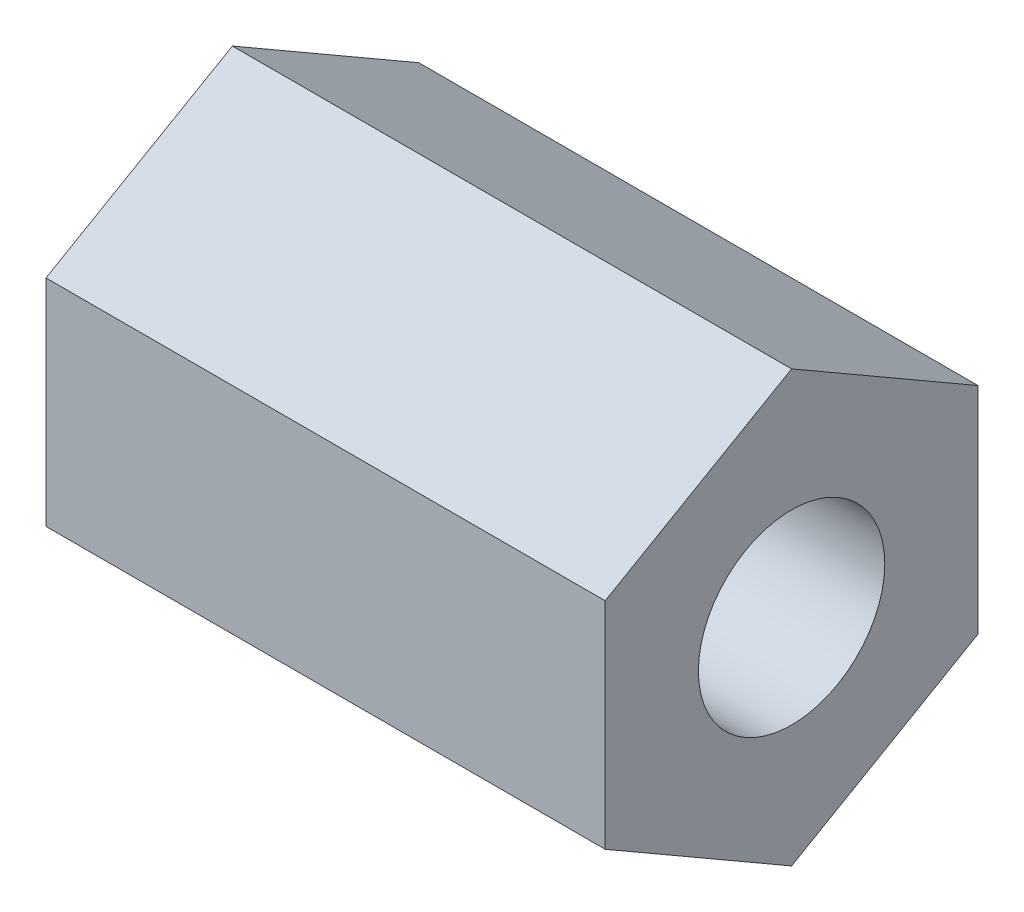
ISO-10303-21;
HEADER;
FILE_DESCRIPTION(('STEP AP214'),'2;1');
FILE_NAME('part.step','',(''),(''),'','','');
FILE_SCHEMA(('AUTOMOTIVE_DESIGN { 1 0 10303 214 1 1 1 1 }'));
ENDSEC;
DATA;
#1=APPLICATION_CONTEXT('core data for automotive mechanical design processes');
#2=APPLICATION_PROTOCOL_DEFINITION('international standard','automotive_design',2000,#1);
#3=PRODUCT_CONTEXT('',#1,'mechanical');
#4=PRODUCT('Part','Part','',(#3));
#5=PRODUCT_RELATED_PRODUCT_CATEGORY('part','',(#4));
#6=PRODUCT_DEFINITION_FORMATION('','',#4);
#7=PRODUCT_DEFINITION_CONTEXT('part definition',#1,'design');
#8=PRODUCT_DEFINITION('design','',#6,#7);
#9=PRODUCT_DEFINITION_SHAPE('','',#8);
#10=(LENGTH_UNIT() NAMED_UNIT(*) SI_UNIT(.MILLI.,.METRE.));
#11=(NAMED_UNIT(*) PLANE_ANGLE_UNIT() SI_UNIT($,.RADIAN.));
#12=(NAMED_UNIT(*) SI_UNIT($,.STERADIAN.) SOLID_ANGLE_UNIT());
#13=UNCERTAINTY_MEASURE_WITH_UNIT(LENGTH_MEASURE(1.E-05),#10,'distance_accuracy_value','');
#14=(GEOMETRIC_REPRESENTATION_CONTEXT(3) GLOBAL_UNCERTAINTY_ASSIGNED_CONTEXT((#13)) GLOBAL_UNIT_ASSIGNED_CONTEXT((#10,
#11,#12)) REPRESENTATION_CONTEXT('',''));
#15=CARTESIAN_POINT('',(0.,0.,0.));
#16=DIRECTION('',(0.,0.,1.));
#17=DIRECTION('',(1.,0.,0.));
#18=AXIS2_PLACEMENT_3D('',#15,#16,#17);
#19=CARTESIAN_POINT('',(19.05,0.,0.));
#20=DIRECTION('',(1.,0.,0.));
#21=DIRECTION('',(0.,0.,-1.));
#22=AXIS2_PLACEMENT_3D('',#19,#20,#21);
#23=PLANE('',#22);
#24=DIRECTION('',(0.,0.499999999999995,0.866025403784442));
#25=VECTOR('',#24,1.);
#26=CARTESIAN_POINT('',(19.05,3.66617420935419,-6.34999999999995));
#27=LINE('',#26,#25);
#28=CARTESIAN_POINT('',(19.05,3.66617420935419,-6.34999999999995));
#29=VERTEX_POINT('',#28);
#30=CARTESIAN_POINT('',(19.05,7.33234841870824,0.));
#31=VERTEX_POINT('',#30);
#32=EDGE_CURVE('E129',#29,#31,#27,.T.);
#33=ORIENTED_EDGE('',*,*,#32,.T.);
#34=DIRECTION('',(0.,-0.500000000000001,0.866025403784438));
#35=VECTOR('',#34,1.);
#36=CARTESIAN_POINT('',(19.05,7.33234841870824,0.));
#37=LINE('',#36,#35);
#38=CARTESIAN_POINT('',(19.05,3.6661742093541,6.35));
#39=VERTEX_POINT('',#38);
#40=EDGE_CURVE('E87',#31,#39,#37,.T.);
#41=ORIENTED_EDGE('',*,*,#40,.T.);
#42=DIRECTION('',(0.,-1.,0.));
#43=VECTOR('',#42,1.);
#44=CARTESIAN_POINT('',(19.05,3.6661742093541,6.35));
#45=LINE('',#44,#43);
#46=CARTESIAN_POINT('',(19.05,-3.66617420935415,6.34999999999997));
#47=VERTEX_POINT('',#46);
#48=EDGE_CURVE('E100',#39,#47,#45,.T.);
#49=ORIENTED_EDGE('',*,*,#48,.T.);
#50=DIRECTION('',(0.,-0.499999999999995,-0.866025403784442));
#51=VECTOR('',#50,1.);
#52=CARTESIAN_POINT('',(19.05,-3.66617420935415,6.34999999999997));
#53=LINE('',#52,#51);
#54=CARTESIAN_POINT('',(19.05,-7.33234841870824,0.));
#55=VERTEX_POINT('',#54);
#56=EDGE_CURVE('E94',#47,#55,#53,.T.);
#57=ORIENTED_EDGE('',*,*,#56,.T.);
#58=DIRECTION('',(0.,0.500000000000007,-0.866025403784435));
#59=VECTOR('',#58,1.);
#60=CARTESIAN_POINT('',(19.05,-7.33234841870824,0.));
#61=LINE('',#60,#59);
#62=CARTESIAN_POINT('',(19.05,-3.66617420935406,-6.35000000000002));
#63=VERTEX_POINT('',#62);
#64=EDGE_CURVE('E98',#55,#63,#61,.T.);
#65=ORIENTED_EDGE('',*,*,#64,.T.);
#66=DIRECTION('',(0.,1.,0.));
#67=VECTOR('',#66,1.);
#68=CARTESIAN_POINT('',(19.05,-3.66617420935406,-6.35000000000002));
#69=LINE('',#68,#67);
#70=EDGE_CURVE('E50',#63,#29,#69,.T.);
#71=ORIENTED_EDGE('',*,*,#70,.T.);
#72=EDGE_LOOP('',(#33,#41,#49,#57,#65,#71));
#73=FACE_BOUND('',#72,.T.);
#74=CARTESIAN_POINT('',(19.05,0.,0.));
#75=DIRECTION('',(1.,0.,0.));
#76=DIRECTION('',(0.,0.,-1.));
#77=AXIS2_PLACEMENT_3D('',#74,#75,#76);
#78=CIRCLE('',#77,3.175);
#79=CARTESIAN_POINT('',(19.05,0.,-3.175));
#80=VERTEX_POINT('',#79);
#81=EDGE_CURVE('E122',#80,#80,#78,.T.);
#82=ORIENTED_EDGE('',*,*,#81,.F.);
#83=EDGE_LOOP('',(#82));
#84=FACE_BOUND('',#83,.T.);
#85=ADVANCED_FACE('F33',(#73,#84),#23,.T.);
#86=CARTESIAN_POINT('',(0.,0.,0.));
#87=DIRECTION('',(1.,0.,0.));
#88=DIRECTION('',(0.,0.,-1.));
#89=AXIS2_PLACEMENT_3D('',#86,#87,#88);
#90=PLANE('',#89);
#91=DIRECTION('',(0.,0.499999999999995,0.866025403784442));
#92=VECTOR('',#91,1.);
#93=CARTESIAN_POINT('',(0.,3.66617420935419,-6.34999999999995));
#94=LINE('',#93,#92);
#95=CARTESIAN_POINT('',(0.,3.66617420935419,-6.34999999999995));
#96=VERTEX_POINT('',#95);
#97=CARTESIAN_POINT('',(0.,7.33234841870824,0.));
#98=VERTEX_POINT('',#97);
#99=EDGE_CURVE('E118',#96,#98,#94,.T.);
#100=ORIENTED_EDGE('',*,*,#99,.F.);
#101=DIRECTION('',(0.,1.,0.));
#102=VECTOR('',#101,1.);
#103=CARTESIAN_POINT('',(0.,-3.66617420935406,-6.35000000000002));
#104=LINE('',#103,#102);
#105=CARTESIAN_POINT('',(0.,-3.66617420935406,-6.35000000000002));
#106=VERTEX_POINT('',#105);
#107=EDGE_CURVE('E79',#106,#96,#104,.T.);
#108=ORIENTED_EDGE('',*,*,#107,.F.);
#109=DIRECTION('',(0.,0.500000000000007,-0.866025403784435));
#110=VECTOR('',#109,1.);
#111=CARTESIAN_POINT('',(0.,-7.33234841870824,0.));
#112=LINE('',#111,#110);
#113=CARTESIAN_POINT('',(0.,-7.33234841870824,0.));
#114=VERTEX_POINT('',#113);
#115=EDGE_CURVE('E73',#114,#106,#112,.T.);
#116=ORIENTED_EDGE('',*,*,#115,.F.);
#117=DIRECTION('',(0.,-0.499999999999995,-0.866025403784442));
#118=VECTOR('',#117,1.);
#119=CARTESIAN_POINT('',(0.,-3.66617420935415,6.34999999999997));
#120=LINE('',#119,#118);
#121=CARTESIAN_POINT('',(0.,-3.66617420935415,6.34999999999997));
#122=VERTEX_POINT('',#121);
#123=EDGE_CURVE('E108',#122,#114,#120,.T.);
#124=ORIENTED_EDGE('',*,*,#123,.F.);
#125=DIRECTION('',(0.,-1.,0.));
#126=VECTOR('',#125,1.);
#127=CARTESIAN_POINT('',(0.,3.6661742093541,6.35));
#128=LINE('',#127,#126);
#129=CARTESIAN_POINT('',(0.,3.6661742093541,6.35));
#130=VERTEX_POINT('',#129);
#131=EDGE_CURVE('E124',#130,#122,#128,.T.);
#132=ORIENTED_EDGE('',*,*,#131,.F.);
#133=DIRECTION('',(0.,-0.500000000000001,0.866025403784438));
#134=VECTOR('',#133,1.);
#135=CARTESIAN_POINT('',(0.,7.33234841870824,0.));
#136=LINE('',#135,#134);
#137=EDGE_CURVE('E121',#98,#130,#136,.T.);
#138=ORIENTED_EDGE('',*,*,#137,.F.);
#139=EDGE_LOOP('',(#100,#108,#116,#124,#132,#138));
#140=FACE_BOUND('',#139,.T.);
#141=CARTESIAN_POINT('',(0.,0.,0.));
#142=DIRECTION('',(1.,0.,0.));
#143=DIRECTION('',(0.,0.,-1.));
#144=AXIS2_PLACEMENT_3D('',#141,#142,#143);
#145=CIRCLE('',#144,3.175);
#146=CARTESIAN_POINT('',(0.,0.,-3.175));
#147=VERTEX_POINT('',#146);
#148=EDGE_CURVE('E222',#147,#147,#145,.T.);
#149=ORIENTED_EDGE('',*,*,#148,.T.);
#150=EDGE_LOOP('',(#149));
#151=FACE_BOUND('',#150,.T.);
#152=ADVANCED_FACE('F138',(#140,#151),#90,.F.);
#153=CARTESIAN_POINT('',(19.05,3.66617420935419,-6.34999999999995));
#154=DIRECTION('',(0.,-0.866025403784442,0.499999999999995));
#155=DIRECTION('',(0.,-0.499999999999995,-0.866025403784442));
#156=AXIS2_PLACEMENT_3D('',#153,#154,#155);
#157=PLANE('',#156);
#158=ORIENTED_EDGE('',*,*,#99,.T.);
#159=DIRECTION('',(-1.,0.,0.));
#160=VECTOR('',#159,1.);
#161=CARTESIAN_POINT('',(19.05,7.33234841870824,0.));
#162=LINE('',#161,#160);
#163=EDGE_CURVE('E11',#31,#98,#162,.T.);
#164=ORIENTED_EDGE('',*,*,#163,.F.);
#165=ORIENTED_EDGE('',*,*,#32,.F.);
#166=DIRECTION('',(-1.,0.,0.));
#167=VECTOR('',#166,1.);
#168=CARTESIAN_POINT('',(19.05,3.66617420935419,-6.34999999999995));
#169=LINE('',#168,#167);
#170=EDGE_CURVE('E114',#29,#96,#169,.T.);
#171=ORIENTED_EDGE('',*,*,#170,.T.);
#172=EDGE_LOOP('',(#158,#164,#165,#171));
#173=FACE_BOUND('',#172,.T.);
#174=ADVANCED_FACE('F35',(#173),#157,.F.);
#175=CARTESIAN_POINT('',(19.05,7.33234841870824,0.));
#176=DIRECTION('',(0.,-0.866025403784438,-0.500000000000001));
#177=DIRECTION('',(0.,0.500000000000001,-0.866025403784438));
#178=AXIS2_PLACEMENT_3D('',#175,#176,#177);
#179=PLANE('',#178);
#180=ORIENTED_EDGE('',*,*,#137,.T.);
#181=DIRECTION('',(-1.,0.,0.));
#182=VECTOR('',#181,1.);
#183=CARTESIAN_POINT('',(19.05,3.6661742093541,6.35));
#184=LINE('',#183,#182);
#185=EDGE_CURVE('E42',#39,#130,#184,.T.);
#186=ORIENTED_EDGE('',*,*,#185,.F.);
#187=ORIENTED_EDGE('',*,*,#40,.F.);
#188=ORIENTED_EDGE('',*,*,#163,.T.);
#189=EDGE_LOOP('',(#180,#186,#187,#188));
#190=FACE_BOUND('',#189,.T.);
#191=ADVANCED_FACE('F163',(#190),#179,.F.);
#192=CARTESIAN_POINT('',(19.05,3.6661742093541,6.35));
#193=DIRECTION('',(0.,0.,-1.));
#194=DIRECTION('',(0.,1.,0.));
#195=AXIS2_PLACEMENT_3D('',#192,#193,#194);
#196=PLANE('',#195);
#197=ORIENTED_EDGE('',*,*,#131,.T.);
#198=DIRECTION('',(-1.,0.,0.));
#199=VECTOR('',#198,1.);
#200=CARTESIAN_POINT('',(19.05,-3.66617420935415,6.34999999999997));
#201=LINE('',#200,#199);
#202=EDGE_CURVE('E109',#47,#122,#201,.T.);
#203=ORIENTED_EDGE('',*,*,#202,.F.);
#204=ORIENTED_EDGE('',*,*,#48,.F.);
#205=ORIENTED_EDGE('',*,*,#185,.T.);
#206=EDGE_LOOP('',(#197,#203,#204,#205));
#207=FACE_BOUND('',#206,.T.);
#208=ADVANCED_FACE('F135',(#207),#196,.F.);
#209=CARTESIAN_POINT('',(19.05,-3.66617420935415,6.34999999999997));
#210=DIRECTION('',(0.,0.866025403784442,-0.499999999999995));
#211=DIRECTION('',(0.,0.499999999999995,0.866025403784442));
#212=AXIS2_PLACEMENT_3D('',#209,#210,#211);
#213=PLANE('',#212);
#214=ORIENTED_EDGE('',*,*,#123,.T.);
#215=DIRECTION('',(-1.,0.,0.));
#216=VECTOR('',#215,1.);
#217=CARTESIAN_POINT('',(19.05,-7.33234841870824,0.));
#218=LINE('',#217,#216);
#219=EDGE_CURVE('E105',#55,#114,#218,.T.);
#220=ORIENTED_EDGE('',*,*,#219,.F.);
#221=ORIENTED_EDGE('',*,*,#56,.F.);
#222=ORIENTED_EDGE('',*,*,#202,.T.);
#223=EDGE_LOOP('',(#214,#220,#221,#222));
#224=FACE_BOUND('',#223,.T.);
#225=ADVANCED_FACE('F106',(#224),#213,.F.);
#226=CARTESIAN_POINT('',(19.05,-7.33234841870824,0.));
#227=DIRECTION('',(0.,0.866025403784435,0.500000000000007));
#228=DIRECTION('',(0.,-0.500000000000007,0.866025403784435));
#229=AXIS2_PLACEMENT_3D('',#226,#227,#228);
#230=PLANE('',#229);
#231=ORIENTED_EDGE('',*,*,#115,.T.);
#232=DIRECTION('',(-1.,0.,0.));
#233=VECTOR('',#232,1.);
#234=CARTESIAN_POINT('',(19.05,-3.66617420935406,-6.35000000000002));
#235=LINE('',#234,#233);
#236=EDGE_CURVE('E110',#63,#106,#235,.T.);
#237=ORIENTED_EDGE('',*,*,#236,.F.);
#238=ORIENTED_EDGE('',*,*,#64,.F.);
#239=ORIENTED_EDGE('',*,*,#219,.T.);
#240=EDGE_LOOP('',(#231,#237,#238,#239));
#241=FACE_BOUND('',#240,.T.);
#242=ADVANCED_FACE('F112',(#241),#230,.F.);
#243=CARTESIAN_POINT('',(19.05,-3.66617420935406,-6.35000000000002));
#244=DIRECTION('',(0.,0.,1.));
#245=DIRECTION('',(0.,-1.,0.));
#246=AXIS2_PLACEMENT_3D('',#243,#244,#245);
#247=PLANE('',#246);
#248=ORIENTED_EDGE('',*,*,#107,.T.);
#249=ORIENTED_EDGE('',*,*,#170,.F.);
#250=ORIENTED_EDGE('',*,*,#70,.F.);
#251=ORIENTED_EDGE('',*,*,#236,.T.);
#252=EDGE_LOOP('',(#248,#249,#250,#251));
#253=FACE_BOUND('',#252,.T.);
#254=ADVANCED_FACE('F143',(#253),#247,.F.);
#255=CARTESIAN_POINT('',(19.05,0.,0.));
#256=DIRECTION('',(-1.,0.,0.));
#257=DIRECTION('',(0.,0.,1.));
#258=AXIS2_PLACEMENT_3D('',#255,#256,#257);
#259=CYLINDRICAL_SURFACE('',#258,3.175);
#260=ORIENTED_EDGE('',*,*,#81,.T.);
#261=EDGE_LOOP('',(#260));
#262=FACE_BOUND('',#261,.T.);
#263=ORIENTED_EDGE('',*,*,#148,.F.);
#264=EDGE_LOOP('',(#263));
#265=FACE_BOUND('',#264,.T.);
#266=ADVANCED_FACE('F145',(#262,#265),#259,.F.);
#267=CLOSED_SHELL('',(#85,#152,#174,#191,#208,#225,#242,#254,#266));
#268=MANIFOLD_SOLID_BREP('B2',#267);
#269=ADVANCED_BREP_SHAPE_REPRESENTATION('',(#18,#268),#14);
#270=SHAPE_DEFINITION_REPRESENTATION(#9,#269);
ENDSEC;
END-ISO-10303-21;
